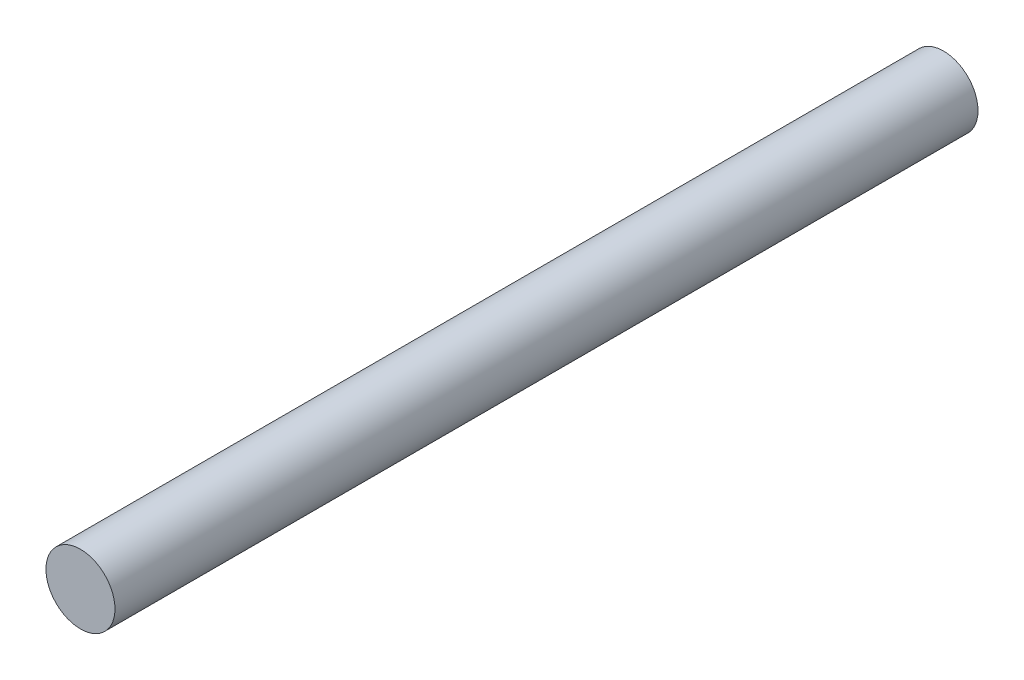
ISO-10303-21;
HEADER;
FILE_DESCRIPTION(('STEP AP214'),'2;1');
FILE_NAME('part.step','',(''),(''),'','','');
FILE_SCHEMA(('AUTOMOTIVE_DESIGN { 1 0 10303 214 1 1 1 1 }'));
ENDSEC;
DATA;
#1=APPLICATION_CONTEXT('core data for automotive mechanical design processes');
#2=APPLICATION_PROTOCOL_DEFINITION('international standard','automotive_design',2000,#1);
#3=PRODUCT_CONTEXT('',#1,'mechanical');
#4=PRODUCT('Part','Part','',(#3));
#5=PRODUCT_RELATED_PRODUCT_CATEGORY('part','',(#4));
#6=PRODUCT_DEFINITION_FORMATION('','',#4);
#7=PRODUCT_DEFINITION_CONTEXT('part definition',#1,'design');
#8=PRODUCT_DEFINITION('design','',#6,#7);
#9=PRODUCT_DEFINITION_SHAPE('','',#8);
#10=(LENGTH_UNIT() NAMED_UNIT(*) SI_UNIT(.MILLI.,.METRE.));
#11=(NAMED_UNIT(*) PLANE_ANGLE_UNIT() SI_UNIT($,.RADIAN.));
#12=(NAMED_UNIT(*) SI_UNIT($,.STERADIAN.) SOLID_ANGLE_UNIT());
#13=UNCERTAINTY_MEASURE_WITH_UNIT(LENGTH_MEASURE(1.E-05),#10,'distance_accuracy_value','');
#14=(GEOMETRIC_REPRESENTATION_CONTEXT(3) GLOBAL_UNCERTAINTY_ASSIGNED_CONTEXT((#13)) GLOBAL_UNIT_ASSIGNED_CONTEXT((#10,
#11,#12)) REPRESENTATION_CONTEXT('',''));
#15=CARTESIAN_POINT('',(0.,0.,0.));
#16=DIRECTION('',(0.,0.,1.));
#17=DIRECTION('',(1.,0.,0.));
#18=AXIS2_PLACEMENT_3D('',#15,#16,#17);
#19=CARTESIAN_POINT('',(0.,0.,25.));
#20=DIRECTION('',(0.,0.,-1.));
#21=DIRECTION('',(-1.,0.,0.));
#22=AXIS2_PLACEMENT_3D('',#19,#20,#21);
#23=CYLINDRICAL_SURFACE('',#22,1.);
#24=CARTESIAN_POINT('',(0.,0.,25.));
#25=DIRECTION('',(0.,0.,1.));
#26=DIRECTION('',(1.,0.,0.));
#27=AXIS2_PLACEMENT_3D('',#24,#25,#26);
#28=CIRCLE('',#27,1.);
#29=CARTESIAN_POINT('',(1.,0.,25.));
#30=VERTEX_POINT('',#29);
#31=EDGE_CURVE('E10',#30,#30,#28,.T.);
#32=ORIENTED_EDGE('',*,*,#31,.F.);
#33=EDGE_LOOP('',(#32));
#34=FACE_BOUND('',#33,.T.);
#35=CARTESIAN_POINT('',(0.,0.,0.));
#36=DIRECTION('',(0.,0.,1.));
#37=DIRECTION('',(1.,0.,0.));
#38=AXIS2_PLACEMENT_3D('',#35,#36,#37);
#39=CIRCLE('',#38,1.);
#40=CARTESIAN_POINT('',(1.,0.,0.));
#41=VERTEX_POINT('',#40);
#42=EDGE_CURVE('E37',#41,#41,#39,.T.);
#43=ORIENTED_EDGE('',*,*,#42,.T.);
#44=EDGE_LOOP('',(#43));
#45=FACE_BOUND('',#44,.T.);
#46=ADVANCED_FACE('F34',(#34,#45),#23,.T.);
#47=CARTESIAN_POINT('',(0.,0.,25.));
#48=DIRECTION('',(0.,0.,1.));
#49=DIRECTION('',(1.,0.,0.));
#50=AXIS2_PLACEMENT_3D('',#47,#48,#49);
#51=PLANE('',#50);
#52=ORIENTED_EDGE('',*,*,#31,.T.);
#53=EDGE_LOOP('',(#52));
#54=FACE_BOUND('',#53,.T.);
#55=ADVANCED_FACE('F49',(#54),#51,.T.);
#56=CARTESIAN_POINT('',(0.,0.,0.));
#57=DIRECTION('',(0.,0.,1.));
#58=DIRECTION('',(1.,0.,0.));
#59=AXIS2_PLACEMENT_3D('',#56,#57,#58);
#60=PLANE('',#59);
#61=ORIENTED_EDGE('',*,*,#42,.F.);
#62=EDGE_LOOP('',(#61));
#63=FACE_BOUND('',#62,.T.);
#64=ADVANCED_FACE('F47',(#63),#60,.F.);
#65=CLOSED_SHELL('',(#46,#55,#64));
#66=MANIFOLD_SOLID_BREP('B2',#65);
#67=ADVANCED_BREP_SHAPE_REPRESENTATION('',(#18,#66),#14);
#68=SHAPE_DEFINITION_REPRESENTATION(#9,#67);
ENDSEC;
END-ISO-10303-21;
